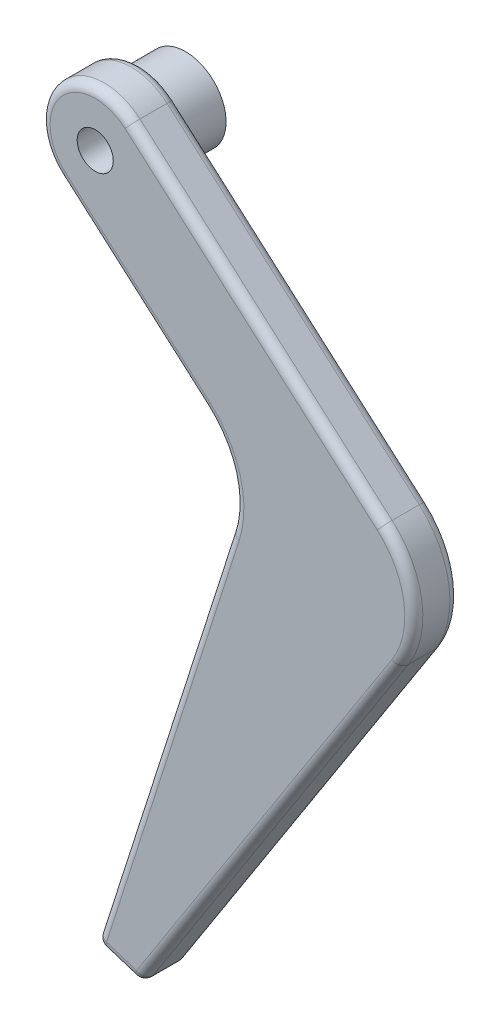
ISO-10303-21;
HEADER;
FILE_DESCRIPTION(('STEP AP214'),'2;1');
FILE_NAME('part.step','',(''),(''),'','','');
FILE_SCHEMA(('AUTOMOTIVE_DESIGN { 1 0 10303 214 1 1 1 1 }'));
ENDSEC;
DATA;
#1=APPLICATION_CONTEXT('core data for automotive mechanical design processes');
#2=APPLICATION_PROTOCOL_DEFINITION('international standard','automotive_design',2000,#1);
#3=PRODUCT_CONTEXT('',#1,'mechanical');
#4=PRODUCT('Part','Part','',(#3));
#5=PRODUCT_RELATED_PRODUCT_CATEGORY('part','',(#4));
#6=PRODUCT_DEFINITION_FORMATION('','',#4);
#7=PRODUCT_DEFINITION_CONTEXT('part definition',#1,'design');
#8=PRODUCT_DEFINITION('design','',#6,#7);
#9=PRODUCT_DEFINITION_SHAPE('','',#8);
#10=(LENGTH_UNIT() NAMED_UNIT(*) SI_UNIT(.MILLI.,.METRE.));
#11=(NAMED_UNIT(*) PLANE_ANGLE_UNIT() SI_UNIT($,.RADIAN.));
#12=(NAMED_UNIT(*) SI_UNIT($,.STERADIAN.) SOLID_ANGLE_UNIT());
#13=UNCERTAINTY_MEASURE_WITH_UNIT(LENGTH_MEASURE(1.E-05),#10,'distance_accuracy_value','');
#14=(GEOMETRIC_REPRESENTATION_CONTEXT(3) GLOBAL_UNCERTAINTY_ASSIGNED_CONTEXT((#13)) GLOBAL_UNIT_ASSIGNED_CONTEXT((#10,
#11,#12)) REPRESENTATION_CONTEXT('',''));
#15=CARTESIAN_POINT('',(0.,0.,0.));
#16=DIRECTION('',(0.,0.,1.));
#17=DIRECTION('',(1.,0.,0.));
#18=AXIS2_PLACEMENT_3D('',#15,#16,#17);
#19=CARTESIAN_POINT('',(-4.52162934195608,-76.1120795077343,2.5));
#20=DIRECTION('',(0.,0.,-1.));
#21=DIRECTION('',(-1.,0.,0.));
#22=AXIS2_PLACEMENT_3D('',#19,#20,#21);
#23=PLANE('',#22);
#24=DIRECTION('',(-0.30502949942289,-0.952342902783352,0.));
#25=VECTOR('',#24,1.);
#26=CARTESIAN_POINT('',(5.95414258866079,-79.4674040013861,2.5));
#27=LINE('',#26,#25);
#28=CARTESIAN_POINT('',(5.95414258866077,-79.4674040013862,2.5));
#29=VERTEX_POINT('',#28);
#30=CARTESIAN_POINT('',(-8.74262759779376,-125.352686596639,2.5));
#31=VERTEX_POINT('',#30);
#32=EDGE_CURVE('E239',#29,#31,#27,.T.);
#33=ORIENTED_EDGE('',*,*,#32,.T.);
#34=DIRECTION('',(0.952342902783352,-0.30502949942289,0.));
#35=VECTOR('',#34,1.);
#36=CARTESIAN_POINT('',(-19.2183995284107,-121.997362102988,2.5));
#37=LINE('',#36,#35);
#38=CARTESIAN_POINT('',(-5.425728911693,-126.415068584158,2.5));
#39=VERTEX_POINT('',#38);
#40=EDGE_CURVE('E248',#31,#39,#37,.T.);
#41=ORIENTED_EDGE('',*,*,#40,.T.);
#42=DIRECTION('',(0.541120351981146,0.840945161512807,0.));
#43=VECTOR('',#42,1.);
#44=CARTESIAN_POINT('',(17.7295046392763,-90.4299470726585,2.5));
#45=LINE('',#44,#43);
#46=CARTESIAN_POINT('',(22.8764762151391,-82.4311334495543,2.5));
#47=VERTEX_POINT('',#46);
#48=EDGE_CURVE('E246',#39,#47,#45,.T.);
#49=ORIENTED_EDGE('',*,*,#48,.T.);
#50=CARTESIAN_POINT('',(15.3079697615239,-77.5610502817239,2.5));
#51=DIRECTION('',(0.,0.,-1.));
#52=DIRECTION('',(-1.,0.,0.));
#53=AXIS2_PLACEMENT_3D('',#50,#51,#52);
#54=CIRCLE('',#53,9.00000000000001);
#55=CARTESIAN_POINT('',(21.2484075454404,-70.8000445181251,2.5));
#56=VERTEX_POINT('',#55);
#57=EDGE_CURVE('E187',#47,#56,#54,.F.);
#58=ORIENTED_EDGE('',*,*,#57,.T.);
#59=DIRECTION('',(-0.751222862622093,0.660048642657394,0.));
#60=VECTOR('',#59,1.);
#61=CARTESIAN_POINT('',(9.33939215384917,-60.3363993926704,2.5));
#62=LINE('',#61,#60);
#63=CARTESIAN_POINT('',(-6.69975678671304,-46.2438856868894,2.5));
#64=VERTEX_POINT('',#63);
#65=EDGE_CURVE('E243',#56,#64,#62,.T.);
#66=ORIENTED_EDGE('',*,*,#65,.T.);
#67=CARTESIAN_POINT('',(-10.,-49.9999999999999,2.5));
#68=DIRECTION('',(0.,0.,-1.));
#69=DIRECTION('',(-1.,0.,0.));
#70=AXIS2_PLACEMENT_3D('',#67,#68,#69);
#71=CIRCLE('',#70,5.);
#72=CARTESIAN_POINT('',(-13.300243213287,-53.7561143131104,2.5));
#73=VERTEX_POINT('',#72);
#74=EDGE_CURVE('E241',#64,#73,#71,.F.);
#75=ORIENTED_EDGE('',*,*,#74,.T.);
#76=DIRECTION('',(0.751222862622093,-0.660048642657394,0.));
#77=VECTOR('',#76,1.);
#78=CARTESIAN_POINT('',(2.73890572727524,-67.8486280188913,2.5));
#79=LINE('',#78,#77);
#80=CARTESIAN_POINT('',(2.7389057272752,-67.8486280188913,2.5));
#81=VERTEX_POINT('',#80);
#82=EDGE_CURVE('E235',#73,#81,#79,.T.);
#83=ORIENTED_EDGE('',*,*,#82,.T.);
#84=CARTESIAN_POINT('',(-4.52162934195608,-76.1120795077343,2.5));
#85=DIRECTION('',(0.,0.,-1.));
#86=DIRECTION('',(-1.,0.,0.));
#87=AXIS2_PLACEMENT_3D('',#84,#85,#86);
#88=CIRCLE('',#87,11.);
#89=EDGE_CURVE('E237',#81,#29,#88,.T.);
#90=ORIENTED_EDGE('',*,*,#89,.T.);
#91=EDGE_LOOP('',(#33,#41,#49,#58,#66,#75,#83,#90));
#92=FACE_BOUND('',#91,.T.);
#93=CARTESIAN_POINT('',(-10.,-49.9999999999999,2.5));
#94=DIRECTION('',(0.,0.,1.));
#95=DIRECTION('',(1.,0.,0.));
#96=AXIS2_PLACEMENT_3D('',#93,#94,#95);
#97=CIRCLE('',#96,2.);
#98=CARTESIAN_POINT('',(-8.00000000000001,-49.9999999999999,2.5));
#99=VERTEX_POINT('',#98);
#100=EDGE_CURVE('E325',#99,#99,#97,.T.);
#101=ORIENTED_EDGE('',*,*,#100,.F.);
#102=EDGE_LOOP('',(#101));
#103=FACE_BOUND('',#102,.T.);
#104=ADVANCED_FACE('F32',(#92,#103),#23,.F.);
#105=CARTESIAN_POINT('',(-4.52162934195608,-76.1120795077343,-2.5));
#106=DIRECTION('',(0.,0.,-1.));
#107=DIRECTION('',(-1.,0.,0.));
#108=AXIS2_PLACEMENT_3D('',#105,#106,#107);
#109=PLANE('',#108);
#110=CARTESIAN_POINT('',(-10.,-49.9999999999999,-2.5));
#111=DIRECTION('',(0.,0.,-1.));
#112=DIRECTION('',(-1.,0.,0.));
#113=AXIS2_PLACEMENT_3D('',#110,#111,#112);
#114=CIRCLE('',#113,4.5);
#115=CARTESIAN_POINT('',(-14.5,-49.9999999999999,-2.5));
#116=VERTEX_POINT('',#115);
#117=EDGE_CURVE('E782',#116,#116,#114,.T.);
#118=ORIENTED_EDGE('',*,*,#117,.F.);
#119=EDGE_LOOP('',(#118));
#120=FACE_BOUND('',#119,.T.);
#121=CARTESIAN_POINT('',(15.3079697615239,-77.5610502817239,-2.5));
#122=DIRECTION('',(0.,0.,-1.));
#123=DIRECTION('',(-1.,0.,0.));
#124=AXIS2_PLACEMENT_3D('',#121,#122,#123);
#125=CIRCLE('',#124,9.00000000000001);
#126=CARTESIAN_POINT('',(21.2484075454404,-70.8000445181251,-2.5));
#127=VERTEX_POINT('',#126);
#128=CARTESIAN_POINT('',(22.8764762151391,-82.4311334495543,-2.5));
#129=VERTEX_POINT('',#128);
#130=EDGE_CURVE('E214',#127,#129,#125,.T.);
#131=ORIENTED_EDGE('',*,*,#130,.T.);
#132=DIRECTION('',(0.541120351981146,0.840945161512807,0.));
#133=VECTOR('',#132,1.);
#134=CARTESIAN_POINT('',(-5.8409451615128,-127.060348501997,-2.5));
#135=LINE('',#134,#133);
#136=CARTESIAN_POINT('',(-5.425728911693,-126.415068584158,-2.5));
#137=VERTEX_POINT('',#136);
#138=EDGE_CURVE('E172',#129,#137,#135,.F.);
#139=ORIENTED_EDGE('',*,*,#138,.T.);
#140=DIRECTION('',(0.952342902783352,-0.30502949942289,0.));
#141=VECTOR('',#140,1.);
#142=CARTESIAN_POINT('',(-9.69497050057711,-125.047657097217,-2.5));
#143=LINE('',#142,#141);
#144=CARTESIAN_POINT('',(-8.74262759779375,-125.352686596639,-2.5));
#145=VERTEX_POINT('',#144);
#146=EDGE_CURVE('E204',#137,#145,#143,.F.);
#147=ORIENTED_EDGE('',*,*,#146,.T.);
#148=DIRECTION('',(-0.30502949942289,-0.952342902783352,0.));
#149=VECTOR('',#148,1.);
#150=CARTESIAN_POINT('',(5.95414258866077,-79.4674040013862,-2.5));
#151=LINE('',#150,#149);
#152=CARTESIAN_POINT('',(5.95414258866077,-79.4674040013862,-2.5));
#153=VERTEX_POINT('',#152);
#154=EDGE_CURVE('E199',#145,#153,#151,.F.);
#155=ORIENTED_EDGE('',*,*,#154,.T.);
#156=CARTESIAN_POINT('',(-4.52162934195608,-76.1120795077343,-2.5));
#157=DIRECTION('',(0.,0.,-1.));
#158=DIRECTION('',(-1.,0.,0.));
#159=AXIS2_PLACEMENT_3D('',#156,#157,#158);
#160=CIRCLE('',#159,11.);
#161=CARTESIAN_POINT('',(2.73890572727521,-67.8486280188913,-2.5));
#162=VERTEX_POINT('',#161);
#163=EDGE_CURVE('E206',#153,#162,#160,.F.);
#164=ORIENTED_EDGE('',*,*,#163,.T.);
#165=DIRECTION('',(0.751222862622093,-0.660048642657394,0.));
#166=VECTOR('',#165,1.);
#167=CARTESIAN_POINT('',(-13.300243213287,-53.7561143131104,-2.5));
#168=LINE('',#167,#166);
#169=CARTESIAN_POINT('',(-13.300243213287,-53.7561143131104,-2.5));
#170=VERTEX_POINT('',#169);
#171=EDGE_CURVE('E208',#162,#170,#168,.F.);
#172=ORIENTED_EDGE('',*,*,#171,.T.);
#173=CARTESIAN_POINT('',(-10.,-49.9999999999999,-2.5));
#174=DIRECTION('',(0.,0.,-1.));
#175=DIRECTION('',(-1.,0.,0.));
#176=AXIS2_PLACEMENT_3D('',#173,#174,#175);
#177=CIRCLE('',#176,5.);
#178=CARTESIAN_POINT('',(-6.69975678671304,-46.2438856868894,-2.5));
#179=VERTEX_POINT('',#178);
#180=EDGE_CURVE('E210',#170,#179,#177,.T.);
#181=ORIENTED_EDGE('',*,*,#180,.T.);
#182=DIRECTION('',(-0.751222862622093,0.660048642657394,0.));
#183=VECTOR('',#182,1.);
#184=CARTESIAN_POINT('',(21.2484075454404,-70.8000445181251,-2.5));
#185=LINE('',#184,#183);
#186=EDGE_CURVE('E212',#179,#127,#185,.F.);
#187=ORIENTED_EDGE('',*,*,#186,.T.);
#188=EDGE_LOOP('',(#131,#139,#147,#155,#164,#172,#181,#187));
#189=FACE_BOUND('',#188,.T.);
#190=ADVANCED_FACE('F362',(#120,#189),#109,.T.);
#191=CARTESIAN_POINT('',(-9.99999999999999,-126.,2.5));
#192=DIRECTION('',(0.952342902783352,-0.30502949942289,0.));
#193=DIRECTION('',(0.30502949942289,0.952342902783352,0.));
#194=AXIS2_PLACEMENT_3D('',#191,#192,#193);
#195=PLANE('',#194);
#196=DIRECTION('',(0.,0.,-1.));
#197=VECTOR('',#196,1.);
#198=CARTESIAN_POINT('',(-9.69497050057711,-125.047657097217,2.5));
#199=LINE('',#198,#197);
#200=CARTESIAN_POINT('',(-9.69497050057711,-125.047657097217,-1.5));
#201=VERTEX_POINT('',#200);
#202=CARTESIAN_POINT('',(-9.69497050057711,-125.047657097217,1.5));
#203=VERTEX_POINT('',#202);
#204=EDGE_CURVE('E252',#201,#203,#199,.F.);
#205=ORIENTED_EDGE('',*,*,#204,.T.);
#206=DIRECTION('',(-0.30502949942289,-0.952342902783352,0.));
#207=VECTOR('',#206,1.);
#208=CARTESIAN_POINT('',(-9.99999999999999,-126.,1.5));
#209=LINE('',#208,#207);
#210=CARTESIAN_POINT('',(5.00179968587742,-79.1623745019633,1.5));
#211=VERTEX_POINT('',#210);
#212=EDGE_CURVE('E254',#203,#211,#209,.F.);
#213=ORIENTED_EDGE('',*,*,#212,.T.);
#214=DIRECTION('',(0.,0.,-1.));
#215=VECTOR('',#214,1.);
#216=CARTESIAN_POINT('',(5.00179968587742,-79.1623745019633,2.5));
#217=LINE('',#216,#215);
#218=CARTESIAN_POINT('',(5.00179968587742,-79.1623745019633,-1.5));
#219=VERTEX_POINT('',#218);
#220=EDGE_CURVE('E330',#211,#219,#217,.T.);
#221=ORIENTED_EDGE('',*,*,#220,.T.);
#222=DIRECTION('',(-0.30502949942289,-0.952342902783352,0.));
#223=VECTOR('',#222,1.);
#224=CARTESIAN_POINT('',(-9.99999999999999,-126.,-1.5));
#225=LINE('',#224,#223);
#226=EDGE_CURVE('E250',#219,#201,#225,.T.);
#227=ORIENTED_EDGE('',*,*,#226,.T.);
#228=EDGE_LOOP('',(#205,#213,#221,#227));
#229=FACE_BOUND('',#228,.T.);
#230=ADVANCED_FACE('F388',(#229),#195,.F.);
#231=CARTESIAN_POINT('',(-9.99999999999999,-126.,2.5));
#232=DIRECTION('',(0.30502949942289,0.952342902783352,0.));
#233=DIRECTION('',(-0.952342902783352,0.30502949942289,0.));
#234=AXIS2_PLACEMENT_3D('',#231,#232,#233);
#235=PLANE('',#234);
#236=DIRECTION('',(0.,0.,-1.));
#237=VECTOR('',#236,1.);
#238=CARTESIAN_POINT('',(-9.04765709721666,-126.305029499423,2.5));
#239=LINE('',#238,#237);
#240=CARTESIAN_POINT('',(-9.04765709721666,-126.305029499423,1.5));
#241=VERTEX_POINT('',#240);
#242=CARTESIAN_POINT('',(-9.04765709721666,-126.305029499423,-1.5));
#243=VERTEX_POINT('',#242);
#244=EDGE_CURVE('E256',#241,#243,#239,.T.);
#245=ORIENTED_EDGE('',*,*,#244,.T.);
#246=DIRECTION('',(0.952342902783352,-0.30502949942289,0.));
#247=VECTOR('',#246,1.);
#248=CARTESIAN_POINT('',(-4.99999999999999,-127.601468853978,-1.5));
#249=LINE('',#248,#247);
#250=CARTESIAN_POINT('',(-5.73075841111589,-127.367411486941,-1.5));
#251=VERTEX_POINT('',#250);
#252=EDGE_CURVE('E11',#243,#251,#249,.T.);
#253=ORIENTED_EDGE('',*,*,#252,.T.);
#254=DIRECTION('',(0.,0.,-1.));
#255=VECTOR('',#254,1.);
#256=CARTESIAN_POINT('',(-5.7307584111159,-127.367411486941,2.5));
#257=LINE('',#256,#255);
#258=CARTESIAN_POINT('',(-5.7307584111159,-127.367411486941,1.5));
#259=VERTEX_POINT('',#258);
#260=EDGE_CURVE('E41',#251,#259,#257,.F.);
#261=ORIENTED_EDGE('',*,*,#260,.T.);
#262=DIRECTION('',(0.952342902783352,-0.30502949942289,0.));
#263=VECTOR('',#262,1.);
#264=CARTESIAN_POINT('',(-9.99999999999999,-126.,1.5));
#265=LINE('',#264,#263);
#266=EDGE_CURVE('E258',#259,#241,#265,.F.);
#267=ORIENTED_EDGE('',*,*,#266,.T.);
#268=EDGE_LOOP('',(#245,#253,#261,#267));
#269=FACE_BOUND('',#268,.T.);
#270=ADVANCED_FACE('F466',(#269),#235,.F.);
#271=CARTESIAN_POINT('',(-5.,-127.601468853978,2.5));
#272=DIRECTION('',(-0.840945161512807,0.541120351981146,0.));
#273=DIRECTION('',(-0.541120351981146,-0.840945161512807,0.));
#274=AXIS2_PLACEMENT_3D('',#271,#272,#273);
#275=PLANE('',#274);
#276=DIRECTION('',(0.,0.,-1.));
#277=VECTOR('',#276,1.);
#278=CARTESIAN_POINT('',(-4.58478375018019,-126.956188936139,2.5));
#279=LINE('',#278,#277);
#280=CARTESIAN_POINT('',(-4.58478375018019,-126.956188936139,1.5));
#281=VERTEX_POINT('',#280);
#282=CARTESIAN_POINT('',(-4.58478375018019,-126.956188936139,-1.5));
#283=VERTEX_POINT('',#282);
#284=EDGE_CURVE('E182',#281,#283,#279,.T.);
#285=ORIENTED_EDGE('',*,*,#284,.T.);
#286=DIRECTION('',(0.541120351981146,0.840945161512807,0.));
#287=VECTOR('',#286,1.);
#288=CARTESIAN_POINT('',(23.7174213766519,-82.9722538015355,-1.5));
#289=LINE('',#288,#287);
#290=CARTESIAN_POINT('',(23.7174213766519,-82.9722538015355,-1.5));
#291=VERTEX_POINT('',#290);
#292=EDGE_CURVE('E181',#283,#291,#289,.T.);
#293=ORIENTED_EDGE('',*,*,#292,.T.);
#294=DIRECTION('',(0.,0.,-1.));
#295=VECTOR('',#294,1.);
#296=CARTESIAN_POINT('',(23.7174213766519,-82.9722538015355,2.5));
#297=LINE('',#296,#295);
#298=CARTESIAN_POINT('',(23.7174213766519,-82.9722538015355,1.5));
#299=VERTEX_POINT('',#298);
#300=EDGE_CURVE('E164',#299,#291,#297,.T.);
#301=ORIENTED_EDGE('',*,*,#300,.F.);
#302=DIRECTION('',(0.541120351981146,0.840945161512807,0.));
#303=VECTOR('',#302,1.);
#304=CARTESIAN_POINT('',(-5.,-127.601468853978,1.5));
#305=LINE('',#304,#303);
#306=EDGE_CURVE('E178',#299,#281,#305,.F.);
#307=ORIENTED_EDGE('',*,*,#306,.T.);
#308=EDGE_LOOP('',(#285,#293,#301,#307));
#309=FACE_BOUND('',#308,.T.);
#310=ADVANCED_FACE('F176',(#309),#275,.F.);
#311=CARTESIAN_POINT('',(15.3079697615239,-77.5610502817239,2.5));
#312=DIRECTION('',(0.,0.,-1.));
#313=DIRECTION('',(-1.,0.,0.));
#314=AXIS2_PLACEMENT_3D('',#311,#312,#313);
#315=CYLINDRICAL_SURFACE('',#314,10.);
#316=ORIENTED_EDGE('',*,*,#300,.T.);
#317=CARTESIAN_POINT('',(15.3079697615239,-77.5610502817239,-1.5));
#318=DIRECTION('',(0.,0.,-1.));
#319=DIRECTION('',(-1.,0.,0.));
#320=AXIS2_PLACEMENT_3D('',#317,#318,#319);
#321=CIRCLE('',#320,10.);
#322=CARTESIAN_POINT('',(21.9084561880978,-70.048821655503,-1.5));
#323=VERTEX_POINT('',#322);
#324=EDGE_CURVE('E171',#291,#323,#321,.F.);
#325=ORIENTED_EDGE('',*,*,#324,.T.);
#326=DIRECTION('',(0.,0.,-1.));
#327=VECTOR('',#326,1.);
#328=CARTESIAN_POINT('',(21.9084561880978,-70.048821655503,2.5));
#329=LINE('',#328,#327);
#330=CARTESIAN_POINT('',(21.9084561880978,-70.048821655503,1.5));
#331=VERTEX_POINT('',#330);
#332=EDGE_CURVE('E166',#331,#323,#329,.T.);
#333=ORIENTED_EDGE('',*,*,#332,.F.);
#334=CARTESIAN_POINT('',(15.3079697615239,-77.5610502817239,1.5));
#335=DIRECTION('',(0.,0.,-1.));
#336=DIRECTION('',(-1.,0.,0.));
#337=AXIS2_PLACEMENT_3D('',#334,#335,#336);
#338=CIRCLE('',#337,10.);
#339=EDGE_CURVE('E161',#331,#299,#338,.T.);
#340=ORIENTED_EDGE('',*,*,#339,.T.);
#341=EDGE_LOOP('',(#316,#325,#333,#340));
#342=FACE_BOUND('',#341,.T.);
#343=ADVANCED_FACE('F163',(#342),#315,.T.);
#344=CARTESIAN_POINT('',(-6.03970814405565,-45.4926628242673,2.5));
#345=DIRECTION('',(-0.660048642657393,-0.751222862622093,0.));
#346=DIRECTION('',(0.751222862622093,-0.660048642657394,0.));
#347=AXIS2_PLACEMENT_3D('',#344,#345,#346);
#348=PLANE('',#347);
#349=ORIENTED_EDGE('',*,*,#332,.T.);
#350=DIRECTION('',(-0.751222862622093,0.660048642657394,0.));
#351=VECTOR('',#350,1.);
#352=CARTESIAN_POINT('',(-6.03970814405565,-45.4926628242673,-1.5));
#353=LINE('',#352,#351);
#354=CARTESIAN_POINT('',(-6.03970814405565,-45.4926628242673,-1.5));
#355=VERTEX_POINT('',#354);
#356=EDGE_CURVE('E221',#323,#355,#353,.T.);
#357=ORIENTED_EDGE('',*,*,#356,.T.);
#358=DIRECTION('',(0.,0.,-1.));
#359=VECTOR('',#358,1.);
#360=CARTESIAN_POINT('',(-6.03970814405565,-45.4926628242673,2.5));
#361=LINE('',#360,#359);
#362=CARTESIAN_POINT('',(-6.03970814405565,-45.4926628242673,1.5));
#363=VERTEX_POINT('',#362);
#364=EDGE_CURVE('E342',#363,#355,#361,.T.);
#365=ORIENTED_EDGE('',*,*,#364,.F.);
#366=DIRECTION('',(-0.751222862622093,0.660048642657394,0.));
#367=VECTOR('',#366,1.);
#368=CARTESIAN_POINT('',(-6.03970814405565,-45.4926628242673,1.5));
#369=LINE('',#368,#367);
#370=EDGE_CURVE('E219',#363,#331,#369,.F.);
#371=ORIENTED_EDGE('',*,*,#370,.T.);
#372=EDGE_LOOP('',(#349,#357,#365,#371));
#373=FACE_BOUND('',#372,.T.);
#374=ADVANCED_FACE('F347',(#373),#348,.F.);
#375=CARTESIAN_POINT('',(-10.,-49.9999999999999,2.5));
#376=DIRECTION('',(0.,0.,-1.));
#377=DIRECTION('',(-1.,0.,0.));
#378=AXIS2_PLACEMENT_3D('',#375,#376,#377);
#379=CYLINDRICAL_SURFACE('',#378,6.);
#380=ORIENTED_EDGE('',*,*,#364,.T.);
#381=CARTESIAN_POINT('',(-10.,-49.9999999999999,-1.5));
#382=DIRECTION('',(0.,0.,-1.));
#383=DIRECTION('',(-1.,0.,0.));
#384=AXIS2_PLACEMENT_3D('',#381,#382,#383);
#385=CIRCLE('',#384,6.);
#386=CARTESIAN_POINT('',(-13.9602918559444,-54.5073371757325,-1.5));
#387=VERTEX_POINT('',#386);
#388=EDGE_CURVE('E225',#355,#387,#385,.F.);
#389=ORIENTED_EDGE('',*,*,#388,.T.);
#390=DIRECTION('',(0.,0.,-1.));
#391=VECTOR('',#390,1.);
#392=CARTESIAN_POINT('',(-13.9602918559444,-54.5073371757325,2.5));
#393=LINE('',#392,#391);
#394=CARTESIAN_POINT('',(-13.9602918559444,-54.5073371757325,1.5));
#395=VERTEX_POINT('',#394);
#396=EDGE_CURVE('E339',#395,#387,#393,.T.);
#397=ORIENTED_EDGE('',*,*,#396,.F.);
#398=CARTESIAN_POINT('',(-10.,-49.9999999999999,1.5));
#399=DIRECTION('',(0.,0.,-1.));
#400=DIRECTION('',(-1.,0.,0.));
#401=AXIS2_PLACEMENT_3D('',#398,#399,#400);
#402=CIRCLE('',#401,6.);
#403=EDGE_CURVE('E223',#395,#363,#402,.T.);
#404=ORIENTED_EDGE('',*,*,#403,.T.);
#405=EDGE_LOOP('',(#380,#389,#397,#404));
#406=FACE_BOUND('',#405,.T.);
#407=ADVANCED_FACE('F423',(#406),#379,.T.);
#408=CARTESIAN_POINT('',(2.07885708461781,-68.5998508815134,2.5));
#409=DIRECTION('',(0.660048642657393,0.751222862622093,0.));
#410=DIRECTION('',(-0.751222862622093,0.660048642657394,0.));
#411=AXIS2_PLACEMENT_3D('',#408,#409,#410);
#412=PLANE('',#411);
#413=ORIENTED_EDGE('',*,*,#396,.T.);
#414=DIRECTION('',(0.751222862622093,-0.660048642657394,0.));
#415=VECTOR('',#414,1.);
#416=CARTESIAN_POINT('',(2.07885708461781,-68.5998508815134,-1.5));
#417=LINE('',#416,#415);
#418=CARTESIAN_POINT('',(2.07885708461781,-68.5998508815134,-1.5));
#419=VERTEX_POINT('',#418);
#420=EDGE_CURVE('E229',#387,#419,#417,.T.);
#421=ORIENTED_EDGE('',*,*,#420,.T.);
#422=DIRECTION('',(0.,0.,-1.));
#423=VECTOR('',#422,1.);
#424=CARTESIAN_POINT('',(2.07885708461781,-68.5998508815134,2.5));
#425=LINE('',#424,#423);
#426=CARTESIAN_POINT('',(2.07885708461781,-68.5998508815134,1.5));
#427=VERTEX_POINT('',#426);
#428=EDGE_CURVE('E336',#427,#419,#425,.T.);
#429=ORIENTED_EDGE('',*,*,#428,.F.);
#430=DIRECTION('',(0.751222862622093,-0.660048642657394,0.));
#431=VECTOR('',#430,1.);
#432=CARTESIAN_POINT('',(2.07885708461781,-68.5998508815134,1.5));
#433=LINE('',#432,#431);
#434=EDGE_CURVE('E227',#427,#395,#433,.F.);
#435=ORIENTED_EDGE('',*,*,#434,.T.);
#436=EDGE_LOOP('',(#413,#421,#429,#435));
#437=FACE_BOUND('',#436,.T.);
#438=ADVANCED_FACE('F412',(#437),#412,.F.);
#439=CARTESIAN_POINT('',(-4.52162934195608,-76.1120795077343,2.5));
#440=DIRECTION('',(0.,0.,-1.));
#441=DIRECTION('',(-1.,0.,0.));
#442=AXIS2_PLACEMENT_3D('',#439,#440,#441);
#443=CYLINDRICAL_SURFACE('',#442,9.99999999999999);
#444=ORIENTED_EDGE('',*,*,#428,.T.);
#445=CARTESIAN_POINT('',(-4.52162934195608,-76.1120795077343,-1.5));
#446=DIRECTION('',(0.,0.,-1.));
#447=DIRECTION('',(-1.,0.,0.));
#448=AXIS2_PLACEMENT_3D('',#445,#446,#447);
#449=CIRCLE('',#448,9.99999999999999);
#450=EDGE_CURVE('E233',#419,#219,#449,.T.);
#451=ORIENTED_EDGE('',*,*,#450,.T.);
#452=ORIENTED_EDGE('',*,*,#220,.F.);
#453=CARTESIAN_POINT('',(-4.52162934195608,-76.1120795077343,1.5));
#454=DIRECTION('',(0.,0.,-1.));
#455=DIRECTION('',(-1.,0.,0.));
#456=AXIS2_PLACEMENT_3D('',#453,#454,#455);
#457=CIRCLE('',#456,9.99999999999999);
#458=EDGE_CURVE('E231',#211,#427,#457,.F.);
#459=ORIENTED_EDGE('',*,*,#458,.T.);
#460=EDGE_LOOP('',(#444,#451,#452,#459));
#461=FACE_BOUND('',#460,.T.);
#462=ADVANCED_FACE('F408',(#461),#443,.F.);
#463=CARTESIAN_POINT('',(-10.,-49.9999999999999,2.5));
#464=DIRECTION('',(0.,0.,-1.));
#465=DIRECTION('',(-1.,0.,0.));
#466=AXIS2_PLACEMENT_3D('',#463,#464,#465);
#467=CYLINDRICAL_SURFACE('',#466,2.);
#468=ORIENTED_EDGE('',*,*,#100,.T.);
#469=EDGE_LOOP('',(#468));
#470=FACE_BOUND('',#469,.T.);
#471=CARTESIAN_POINT('',(-10.,-49.9999999999999,-2.5));
#472=DIRECTION('',(0.,0.,1.));
#473=DIRECTION('',(1.,0.,0.));
#474=AXIS2_PLACEMENT_3D('',#471,#472,#473);
#475=CIRCLE('',#474,2.);
#476=CARTESIAN_POINT('',(-8.00000000000001,-49.9999999999999,-2.5));
#477=VERTEX_POINT('',#476);
#478=EDGE_CURVE('E319',#477,#477,#475,.T.);
#479=ORIENTED_EDGE('',*,*,#478,.F.);
#480=EDGE_LOOP('',(#479));
#481=FACE_BOUND('',#480,.T.);
#482=ADVANCED_FACE('F451',(#470,#481),#467,.F.);
#483=CARTESIAN_POINT('',(2.73890572727524,-67.8486280188913,1.5));
#484=DIRECTION('',(0.751222862622093,-0.660048642657394,0.));
#485=DIRECTION('',(0.660048642657393,0.751222862622093,0.));
#486=AXIS2_PLACEMENT_3D('',#483,#484,#485);
#487=CYLINDRICAL_SURFACE('',#486,1.);
#488=CARTESIAN_POINT('',(-13.300243213287,-53.7561143131104,1.5));
#489=DIRECTION('',(-0.751222862622094,0.660048642657393,0.));
#490=DIRECTION('',(-0.660048642657393,-0.751222862622094,0.));
#491=AXIS2_PLACEMENT_3D('',#488,#489,#490);
#492=CIRCLE('',#491,1.);
#493=EDGE_CURVE('E315',#395,#73,#492,.T.);
#494=ORIENTED_EDGE('',*,*,#493,.F.);
#495=ORIENTED_EDGE('',*,*,#434,.F.);
#496=CARTESIAN_POINT('',(2.7389057272752,-67.8486280188913,1.5));
#497=DIRECTION('',(0.751222862622095,-0.660048642657392,0.));
#498=DIRECTION('',(0.660048642657392,0.751222862622095,0.));
#499=AXIS2_PLACEMENT_3D('',#496,#497,#498);
#500=CIRCLE('',#499,1.);
#501=EDGE_CURVE('E317',#81,#427,#500,.T.);
#502=ORIENTED_EDGE('',*,*,#501,.F.);
#503=ORIENTED_EDGE('',*,*,#82,.F.);
#504=EDGE_LOOP('',(#494,#495,#502,#503));
#505=FACE_BOUND('',#504,.T.);
#506=ADVANCED_FACE('F34',(#505),#487,.T.);
#507=CARTESIAN_POINT('',(-4.52162934195608,-76.1120795077343,1.5));
#508=DIRECTION('',(0.,0.,-1.));
#509=DIRECTION('',(-1.,0.,0.));
#510=AXIS2_PLACEMENT_3D('',#507,#508,#509);
#511=TOROIDAL_SURFACE('',#510,11.,1.);
#512=ORIENTED_EDGE('',*,*,#501,.T.);
#513=ORIENTED_EDGE('',*,*,#458,.F.);
#514=CARTESIAN_POINT('',(5.95414258866077,-79.4674040013862,1.5));
#515=DIRECTION('',(-0.30502949942289,-0.952342902783352,0.));
#516=DIRECTION('',(0.952342902783352,-0.30502949942289,0.));
#517=AXIS2_PLACEMENT_3D('',#514,#515,#516);
#518=CIRCLE('',#517,1.);
#519=EDGE_CURVE('E312',#29,#211,#518,.T.);
#520=ORIENTED_EDGE('',*,*,#519,.F.);
#521=ORIENTED_EDGE('',*,*,#89,.F.);
#522=EDGE_LOOP('',(#512,#513,#520,#521));
#523=FACE_BOUND('',#522,.T.);
#524=ADVANCED_FACE('F405',(#523),#511,.T.);
#525=CARTESIAN_POINT('',(-10.,-49.9999999999999,1.5));
#526=DIRECTION('',(0.,0.,-1.));
#527=DIRECTION('',(-1.,0.,0.));
#528=AXIS2_PLACEMENT_3D('',#525,#526,#527);
#529=TOROIDAL_SURFACE('',#528,5.,1.);
#530=ORIENTED_EDGE('',*,*,#493,.T.);
#531=ORIENTED_EDGE('',*,*,#74,.F.);
#532=CARTESIAN_POINT('',(-6.69975678671304,-46.2438856868894,1.5));
#533=DIRECTION('',(0.751222862622094,-0.660048642657393,0.));
#534=DIRECTION('',(0.660048642657393,0.751222862622094,0.));
#535=AXIS2_PLACEMENT_3D('',#532,#533,#534);
#536=CIRCLE('',#535,1.);
#537=EDGE_CURVE('E309',#363,#64,#536,.T.);
#538=ORIENTED_EDGE('',*,*,#537,.F.);
#539=ORIENTED_EDGE('',*,*,#403,.F.);
#540=EDGE_LOOP('',(#530,#531,#538,#539));
#541=FACE_BOUND('',#540,.T.);
#542=ADVANCED_FACE('F421',(#541),#529,.T.);
#543=CARTESIAN_POINT('',(5.95414258866078,-79.4674040013861,1.5));
#544=DIRECTION('',(-0.30502949942289,-0.952342902783352,0.));
#545=DIRECTION('',(0.952342902783352,-0.30502949942289,0.));
#546=AXIS2_PLACEMENT_3D('',#543,#544,#545);
#547=CYLINDRICAL_SURFACE('',#546,1.);
#548=ORIENTED_EDGE('',*,*,#519,.T.);
#549=ORIENTED_EDGE('',*,*,#212,.F.);
#550=CARTESIAN_POINT('',(-8.74262759779376,-125.352686596639,1.5));
#551=DIRECTION('',(-0.305029499422878,-0.952342902783356,0.));
#552=DIRECTION('',(0.952342902783356,-0.305029499422878,0.));
#553=AXIS2_PLACEMENT_3D('',#550,#551,#552);
#554=CIRCLE('',#553,1.);
#555=EDGE_CURVE('E306',#31,#203,#554,.T.);
#556=ORIENTED_EDGE('',*,*,#555,.F.);
#557=ORIENTED_EDGE('',*,*,#32,.F.);
#558=EDGE_LOOP('',(#548,#549,#556,#557));
#559=FACE_BOUND('',#558,.T.);
#560=ADVANCED_FACE('F392',(#559),#547,.T.);
#561=CARTESIAN_POINT('',(9.33939215384917,-60.3363993926704,1.5));
#562=DIRECTION('',(-0.751222862622093,0.660048642657394,0.));
#563=DIRECTION('',(-0.660048642657393,-0.751222862622093,0.));
#564=AXIS2_PLACEMENT_3D('',#561,#562,#563);
#565=CYLINDRICAL_SURFACE('',#564,1.);
#566=ORIENTED_EDGE('',*,*,#537,.T.);
#567=ORIENTED_EDGE('',*,*,#65,.F.);
#568=CARTESIAN_POINT('',(21.2484075454404,-70.8000445181251,1.5));
#569=DIRECTION('',(0.751222862622094,-0.660048642657392,0.));
#570=DIRECTION('',(0.660048642657392,0.751222862622094,0.));
#571=AXIS2_PLACEMENT_3D('',#568,#569,#570);
#572=CIRCLE('',#571,1.);
#573=EDGE_CURVE('E304',#331,#56,#572,.T.);
#574=ORIENTED_EDGE('',*,*,#573,.F.);
#575=ORIENTED_EDGE('',*,*,#370,.F.);
#576=EDGE_LOOP('',(#566,#567,#574,#575));
#577=FACE_BOUND('',#576,.T.);
#578=ADVANCED_FACE('F659',(#577),#565,.T.);
#579=CARTESIAN_POINT('',(-8.74262759779376,-125.352686596639,1.5));
#580=DIRECTION('',(-0.952342902783356,0.305029499422879,0.));
#581=DIRECTION('',(-0.305029499422879,-0.952342902783356,0.));
#582=AXIS2_PLACEMENT_3D('',#579,#580,#581);
#583=SPHERICAL_SURFACE('',#582,1.);
#584=CARTESIAN_POINT('',(-8.74262759779377,-125.352686596639,1.5));
#585=DIRECTION('',(-0.952342902783351,0.305029499422893,0.));
#586=DIRECTION('',(-0.305029499422893,-0.952342902783351,0.));
#587=AXIS2_PLACEMENT_3D('',#584,#585,#586);
#588=CIRCLE('',#587,1.);
#589=EDGE_CURVE('E191',#31,#241,#588,.F.);
#590=ORIENTED_EDGE('',*,*,#589,.F.);
#591=ORIENTED_EDGE('',*,*,#555,.T.);
#592=CARTESIAN_POINT('',(-8.74262759779376,-125.352686596639,1.5));
#593=DIRECTION('',(0.,0.,1.));
#594=DIRECTION('',(1.,0.,0.));
#595=AXIS2_PLACEMENT_3D('',#592,#593,#594);
#596=CIRCLE('',#595,1.);
#597=EDGE_CURVE('E298',#241,#203,#596,.F.);
#598=ORIENTED_EDGE('',*,*,#597,.F.);
#599=EDGE_LOOP('',(#590,#591,#598));
#600=FACE_BOUND('',#599,.T.);
#601=ADVANCED_FACE('F397',(#600),#583,.T.);
#602=CARTESIAN_POINT('',(15.3079697615239,-77.5610502817239,1.5));
#603=DIRECTION('',(0.,0.,-1.));
#604=DIRECTION('',(-1.,0.,0.));
#605=AXIS2_PLACEMENT_3D('',#602,#603,#604);
#606=TOROIDAL_SURFACE('',#605,9.00000000000001,1.);
#607=ORIENTED_EDGE('',*,*,#573,.T.);
#608=ORIENTED_EDGE('',*,*,#57,.F.);
#609=CARTESIAN_POINT('',(22.8764762151391,-82.4311334495543,1.5));
#610=DIRECTION('',(-0.541120351981147,-0.840945161512806,0.));
#611=DIRECTION('',(0.840945161512806,-0.541120351981147,0.));
#612=AXIS2_PLACEMENT_3D('',#609,#610,#611);
#613=CIRCLE('',#612,1.);
#614=EDGE_CURVE('E185',#299,#47,#613,.T.);
#615=ORIENTED_EDGE('',*,*,#614,.F.);
#616=ORIENTED_EDGE('',*,*,#339,.F.);
#617=EDGE_LOOP('',(#607,#608,#615,#616));
#618=FACE_BOUND('',#617,.T.);
#619=ADVANCED_FACE('F186',(#618),#606,.T.);
#620=CARTESIAN_POINT('',(-4.52162934195608,-76.1120795077343,-1.5));
#621=DIRECTION('',(0.,0.,-1.));
#622=DIRECTION('',(-1.,0.,0.));
#623=AXIS2_PLACEMENT_3D('',#620,#621,#622);
#624=TOROIDAL_SURFACE('',#623,11.,1.);
#625=CARTESIAN_POINT('',(2.73890572727521,-67.8486280188913,-1.5));
#626=DIRECTION('',(-0.751222862622094,0.660048642657393,0.));
#627=DIRECTION('',(-0.660048642657393,-0.751222862622094,0.));
#628=AXIS2_PLACEMENT_3D('',#625,#626,#627);
#629=CIRCLE('',#628,1.);
#630=EDGE_CURVE('E192',#162,#419,#629,.T.);
#631=ORIENTED_EDGE('',*,*,#630,.F.);
#632=ORIENTED_EDGE('',*,*,#163,.F.);
#633=CARTESIAN_POINT('',(5.95414258866077,-79.4674040013862,-1.5));
#634=DIRECTION('',(-0.305029499422891,-0.952342902783352,0.));
#635=DIRECTION('',(0.952342902783352,-0.305029499422891,0.));
#636=AXIS2_PLACEMENT_3D('',#633,#634,#635);
#637=CIRCLE('',#636,1.);
#638=EDGE_CURVE('E301',#219,#153,#637,.T.);
#639=ORIENTED_EDGE('',*,*,#638,.F.);
#640=ORIENTED_EDGE('',*,*,#450,.F.);
#641=EDGE_LOOP('',(#631,#632,#639,#640));
#642=FACE_BOUND('',#641,.T.);
#643=ADVANCED_FACE('F434',(#642),#624,.T.);
#644=CARTESIAN_POINT('',(-9.04765709721664,-126.305029499423,-1.5));
#645=DIRECTION('',(0.30502949942289,0.952342902783352,0.));
#646=DIRECTION('',(-0.952342902783352,0.30502949942289,0.));
#647=AXIS2_PLACEMENT_3D('',#644,#645,#646);
#648=CYLINDRICAL_SURFACE('',#647,1.);
#649=ORIENTED_EDGE('',*,*,#638,.T.);
#650=ORIENTED_EDGE('',*,*,#154,.F.);
#651=CARTESIAN_POINT('',(-8.74262759779376,-125.352686596639,-1.5));
#652=DIRECTION('',(-0.305029499422878,-0.952342902783356,0.));
#653=DIRECTION('',(0.952342902783356,-0.305029499422878,0.));
#654=AXIS2_PLACEMENT_3D('',#651,#652,#653);
#655=CIRCLE('',#654,1.);
#656=EDGE_CURVE('E291',#201,#145,#655,.T.);
#657=ORIENTED_EDGE('',*,*,#656,.F.);
#658=ORIENTED_EDGE('',*,*,#226,.F.);
#659=EDGE_LOOP('',(#649,#650,#657,#658));
#660=FACE_BOUND('',#659,.T.);
#661=ADVANCED_FACE('F375',(#660),#648,.T.);
#662=CARTESIAN_POINT('',(-8.74262759779376,-125.352686596639,2.5));
#663=DIRECTION('',(0.,0.,-1.));
#664=DIRECTION('',(-1.,0.,0.));
#665=AXIS2_PLACEMENT_3D('',#662,#663,#664);
#666=CYLINDRICAL_SURFACE('',#665,1.);
#667=ORIENTED_EDGE('',*,*,#597,.T.);
#668=ORIENTED_EDGE('',*,*,#204,.F.);
#669=CARTESIAN_POINT('',(-8.74262759779377,-125.352686596639,-1.5));
#670=DIRECTION('',(0.,0.,-1.));
#671=DIRECTION('',(-1.,0.,0.));
#672=AXIS2_PLACEMENT_3D('',#669,#670,#671);
#673=CIRCLE('',#672,1.);
#674=EDGE_CURVE('E288',#243,#201,#673,.T.);
#675=ORIENTED_EDGE('',*,*,#674,.F.);
#676=ORIENTED_EDGE('',*,*,#244,.F.);
#677=EDGE_LOOP('',(#667,#668,#675,#676));
#678=FACE_BOUND('',#677,.T.);
#679=ADVANCED_FACE('F384',(#678),#666,.T.);
#680=CARTESIAN_POINT('',(-19.2183995284107,-121.997362102988,1.5));
#681=DIRECTION('',(0.952342902783352,-0.30502949942289,0.));
#682=DIRECTION('',(0.30502949942289,0.952342902783352,0.));
#683=AXIS2_PLACEMENT_3D('',#680,#681,#682);
#684=CYLINDRICAL_SURFACE('',#683,1.);
#685=ORIENTED_EDGE('',*,*,#589,.T.);
#686=ORIENTED_EDGE('',*,*,#266,.F.);
#687=CARTESIAN_POINT('',(-5.425728911693,-126.415068584158,1.5));
#688=DIRECTION('',(0.952342902783349,-0.305029499422898,0.));
#689=DIRECTION('',(0.305029499422898,0.95234290278335,0.));
#690=AXIS2_PLACEMENT_3D('',#687,#688,#689);
#691=CIRCLE('',#690,1.);
#692=EDGE_CURVE('E285',#39,#259,#691,.T.);
#693=ORIENTED_EDGE('',*,*,#692,.F.);
#694=ORIENTED_EDGE('',*,*,#40,.F.);
#695=EDGE_LOOP('',(#685,#686,#693,#694));
#696=FACE_BOUND('',#695,.T.);
#697=ADVANCED_FACE('F401',(#696),#684,.T.);
#698=CARTESIAN_POINT('',(17.7295046392763,-90.4299470726585,1.5));
#699=DIRECTION('',(0.541120351981146,0.840945161512807,0.));
#700=DIRECTION('',(-0.840945161512807,0.541120351981146,0.));
#701=AXIS2_PLACEMENT_3D('',#698,#699,#700);
#702=CYLINDRICAL_SURFACE('',#701,1.);
#703=ORIENTED_EDGE('',*,*,#614,.T.);
#704=ORIENTED_EDGE('',*,*,#48,.F.);
#705=CARTESIAN_POINT('',(-5.42572891169299,-126.415068584158,1.5));
#706=DIRECTION('',(-0.541120351981145,-0.840945161512807,0.));
#707=DIRECTION('',(0.840945161512807,-0.541120351981145,0.));
#708=AXIS2_PLACEMENT_3D('',#705,#706,#707);
#709=CIRCLE('',#708,1.);
#710=EDGE_CURVE('E196',#281,#39,#709,.T.);
#711=ORIENTED_EDGE('',*,*,#710,.F.);
#712=ORIENTED_EDGE('',*,*,#306,.F.);
#713=EDGE_LOOP('',(#703,#704,#711,#712));
#714=FACE_BOUND('',#713,.T.);
#715=ADVANCED_FACE('F194',(#714),#702,.T.);
#716=CARTESIAN_POINT('',(2.7389057272752,-67.8486280188913,-1.5));
#717=DIRECTION('',(-0.751222862622093,0.660048642657394,0.));
#718=DIRECTION('',(-0.660048642657393,-0.751222862622093,0.));
#719=AXIS2_PLACEMENT_3D('',#716,#717,#718);
#720=CYLINDRICAL_SURFACE('',#719,1.);
#721=ORIENTED_EDGE('',*,*,#630,.T.);
#722=ORIENTED_EDGE('',*,*,#420,.F.);
#723=CARTESIAN_POINT('',(-13.300243213287,-53.7561143131104,-1.5));
#724=DIRECTION('',(-0.751222862622094,0.660048642657392,0.));
#725=DIRECTION('',(-0.660048642657392,-0.751222862622094,0.));
#726=AXIS2_PLACEMENT_3D('',#723,#724,#725);
#727=CIRCLE('',#726,1.);
#728=EDGE_CURVE('E281',#170,#387,#727,.T.);
#729=ORIENTED_EDGE('',*,*,#728,.F.);
#730=ORIENTED_EDGE('',*,*,#171,.F.);
#731=EDGE_LOOP('',(#721,#722,#729,#730));
#732=FACE_BOUND('',#731,.T.);
#733=ADVANCED_FACE('F427',(#732),#720,.T.);
#734=CARTESIAN_POINT('',(-8.74262759779376,-125.352686596639,-1.5));
#735=DIRECTION('',(-0.952342902783356,0.305029499422879,0.));
#736=DIRECTION('',(-0.305029499422879,-0.952342902783356,0.));
#737=AXIS2_PLACEMENT_3D('',#734,#735,#736);
#738=SPHERICAL_SURFACE('',#737,1.);
#739=ORIENTED_EDGE('',*,*,#674,.T.);
#740=ORIENTED_EDGE('',*,*,#656,.T.);
#741=CARTESIAN_POINT('',(-8.74262759779376,-125.352686596639,-1.5));
#742=DIRECTION('',(-0.952342902783349,0.305029499422899,0.));
#743=DIRECTION('',(-0.305029499422899,-0.952342902783349,0.));
#744=AXIS2_PLACEMENT_3D('',#741,#742,#743);
#745=CIRCLE('',#744,1.);
#746=EDGE_CURVE('E278',#243,#145,#745,.F.);
#747=ORIENTED_EDGE('',*,*,#746,.F.);
#748=EDGE_LOOP('',(#739,#740,#747));
#749=FACE_BOUND('',#748,.T.);
#750=ADVANCED_FACE('F379',(#749),#738,.T.);
#751=CARTESIAN_POINT('',(-5.425728911693,-126.415068584158,1.5));
#752=DIRECTION('',(0.,0.,1.));
#753=DIRECTION('',(1.,0.,0.));
#754=AXIS2_PLACEMENT_3D('',#751,#752,#753);
#755=SPHERICAL_SURFACE('',#754,1.);
#756=ORIENTED_EDGE('',*,*,#710,.T.);
#757=ORIENTED_EDGE('',*,*,#692,.T.);
#758=CARTESIAN_POINT('',(-5.425728911693,-126.415068584158,1.5));
#759=DIRECTION('',(0.,0.,1.));
#760=DIRECTION('',(1.,0.,0.));
#761=AXIS2_PLACEMENT_3D('',#758,#759,#760);
#762=CIRCLE('',#761,1.);
#763=EDGE_CURVE('E275',#281,#259,#762,.F.);
#764=ORIENTED_EDGE('',*,*,#763,.F.);
#765=EDGE_LOOP('',(#756,#757,#764));
#766=FACE_BOUND('',#765,.T.);
#767=ADVANCED_FACE('F488',(#766),#755,.T.);
#768=CARTESIAN_POINT('',(-10.,-49.9999999999999,-1.5));
#769=DIRECTION('',(0.,0.,-1.));
#770=DIRECTION('',(-1.,0.,0.));
#771=AXIS2_PLACEMENT_3D('',#768,#769,#770);
#772=TOROIDAL_SURFACE('',#771,5.,1.);
#773=ORIENTED_EDGE('',*,*,#728,.T.);
#774=ORIENTED_EDGE('',*,*,#388,.F.);
#775=CARTESIAN_POINT('',(-6.69975678671304,-46.2438856868894,-1.5));
#776=DIRECTION('',(0.751222862622093,-0.660048642657394,0.));
#777=DIRECTION('',(0.660048642657394,0.751222862622093,0.));
#778=AXIS2_PLACEMENT_3D('',#775,#776,#777);
#779=CIRCLE('',#778,1.);
#780=EDGE_CURVE('E272',#179,#355,#779,.T.);
#781=ORIENTED_EDGE('',*,*,#780,.F.);
#782=ORIENTED_EDGE('',*,*,#180,.F.);
#783=EDGE_LOOP('',(#773,#774,#781,#782));
#784=FACE_BOUND('',#783,.T.);
#785=ADVANCED_FACE('F432',(#784),#772,.T.);
#786=CARTESIAN_POINT('',(-9.6949705005771,-125.047657097217,-1.5));
#787=DIRECTION('',(-0.952342902783352,0.30502949942289,0.));
#788=DIRECTION('',(-0.30502949942289,-0.952342902783352,0.));
#789=AXIS2_PLACEMENT_3D('',#786,#787,#788);
#790=CYLINDRICAL_SURFACE('',#789,1.);
#791=ORIENTED_EDGE('',*,*,#746,.T.);
#792=ORIENTED_EDGE('',*,*,#146,.F.);
#793=CARTESIAN_POINT('',(-5.42572891169301,-126.415068584158,-1.5));
#794=DIRECTION('',(0.952342902783351,-0.305029499422893,0.));
#795=DIRECTION('',(0.305029499422893,0.952342902783351,0.));
#796=AXIS2_PLACEMENT_3D('',#793,#794,#795);
#797=CIRCLE('',#796,1.);
#798=EDGE_CURVE('E270',#251,#137,#797,.T.);
#799=ORIENTED_EDGE('',*,*,#798,.F.);
#800=ORIENTED_EDGE('',*,*,#252,.F.);
#801=EDGE_LOOP('',(#791,#792,#799,#800));
#802=FACE_BOUND('',#801,.T.);
#803=ADVANCED_FACE('F369',(#802),#790,.T.);
#804=CARTESIAN_POINT('',(-5.425728911693,-126.415068584158,2.5));
#805=DIRECTION('',(0.,0.,-1.));
#806=DIRECTION('',(-1.,0.,0.));
#807=AXIS2_PLACEMENT_3D('',#804,#805,#806);
#808=CYLINDRICAL_SURFACE('',#807,1.);
#809=ORIENTED_EDGE('',*,*,#763,.T.);
#810=ORIENTED_EDGE('',*,*,#260,.F.);
#811=CARTESIAN_POINT('',(-5.42572891169299,-126.415068584158,-1.5));
#812=DIRECTION('',(0.,0.,-1.));
#813=DIRECTION('',(-1.,0.,0.));
#814=AXIS2_PLACEMENT_3D('',#811,#812,#813);
#815=CIRCLE('',#814,1.);
#816=EDGE_CURVE('E49',#283,#251,#815,.T.);
#817=ORIENTED_EDGE('',*,*,#816,.F.);
#818=ORIENTED_EDGE('',*,*,#284,.F.);
#819=EDGE_LOOP('',(#809,#810,#817,#818));
#820=FACE_BOUND('',#819,.T.);
#821=ADVANCED_FACE('F480',(#820),#808,.T.);
#822=CARTESIAN_POINT('',(-6.69975678671304,-46.2438856868894,-1.5));
#823=DIRECTION('',(0.751222862622093,-0.660048642657394,0.));
#824=DIRECTION('',(0.660048642657393,0.751222862622093,0.));
#825=AXIS2_PLACEMENT_3D('',#822,#823,#824);
#826=CYLINDRICAL_SURFACE('',#825,1.);
#827=ORIENTED_EDGE('',*,*,#780,.T.);
#828=ORIENTED_EDGE('',*,*,#356,.F.);
#829=CARTESIAN_POINT('',(21.2484075454404,-70.8000445181251,-1.5));
#830=DIRECTION('',(0.751222862622094,-0.660048642657392,0.));
#831=DIRECTION('',(0.660048642657392,0.751222862622094,0.));
#832=AXIS2_PLACEMENT_3D('',#829,#830,#831);
#833=CIRCLE('',#832,1.);
#834=EDGE_CURVE('E266',#127,#323,#833,.T.);
#835=ORIENTED_EDGE('',*,*,#834,.F.);
#836=ORIENTED_EDGE('',*,*,#186,.F.);
#837=EDGE_LOOP('',(#827,#828,#835,#836));
#838=FACE_BOUND('',#837,.T.);
#839=ADVANCED_FACE('F352',(#838),#826,.T.);
#840=CARTESIAN_POINT('',(-5.425728911693,-126.415068584158,-1.5));
#841=DIRECTION('',(0.,0.,-1.));
#842=DIRECTION('',(0.,1.,0.));
#843=AXIS2_PLACEMENT_3D('',#840,#841,#842);
#844=SPHERICAL_SURFACE('',#843,1.);
#845=ORIENTED_EDGE('',*,*,#816,.T.);
#846=ORIENTED_EDGE('',*,*,#798,.T.);
#847=CARTESIAN_POINT('',(-5.42572891169299,-126.415068584158,-1.5));
#848=DIRECTION('',(-0.541120351981145,-0.840945161512808,0.));
#849=DIRECTION('',(0.840945161512808,-0.541120351981145,0.));
#850=AXIS2_PLACEMENT_3D('',#847,#848,#849);
#851=CIRCLE('',#850,1.);
#852=EDGE_CURVE('E263',#283,#137,#851,.F.);
#853=ORIENTED_EDGE('',*,*,#852,.F.);
#854=EDGE_LOOP('',(#845,#846,#853));
#855=FACE_BOUND('',#854,.T.);
#856=ADVANCED_FACE('F366',(#855),#844,.T.);
#857=CARTESIAN_POINT('',(15.3079697615239,-77.5610502817239,-1.5));
#858=DIRECTION('',(0.,0.,-1.));
#859=DIRECTION('',(-1.,0.,0.));
#860=AXIS2_PLACEMENT_3D('',#857,#858,#859);
#861=TOROIDAL_SURFACE('',#860,9.00000000000001,1.);
#862=ORIENTED_EDGE('',*,*,#834,.T.);
#863=ORIENTED_EDGE('',*,*,#324,.F.);
#864=CARTESIAN_POINT('',(22.8764762151391,-82.4311334495543,-1.5));
#865=DIRECTION('',(-0.541120351981144,-0.840945161512808,0.));
#866=DIRECTION('',(0.840945161512808,-0.541120351981144,0.));
#867=AXIS2_PLACEMENT_3D('',#864,#865,#866);
#868=CIRCLE('',#867,1.);
#869=EDGE_CURVE('E261',#129,#291,#868,.T.);
#870=ORIENTED_EDGE('',*,*,#869,.F.);
#871=ORIENTED_EDGE('',*,*,#130,.F.);
#872=EDGE_LOOP('',(#862,#863,#870,#871));
#873=FACE_BOUND('',#872,.T.);
#874=ADVANCED_FACE('F358',(#873),#861,.T.);
#875=CARTESIAN_POINT('',(-5.8409451615128,-127.060348501997,-1.5));
#876=DIRECTION('',(-0.541120351981146,-0.840945161512807,0.));
#877=DIRECTION('',(0.840945161512807,-0.541120351981146,0.));
#878=AXIS2_PLACEMENT_3D('',#875,#876,#877);
#879=CYLINDRICAL_SURFACE('',#878,1.);
#880=ORIENTED_EDGE('',*,*,#852,.T.);
#881=ORIENTED_EDGE('',*,*,#138,.F.);
#882=ORIENTED_EDGE('',*,*,#869,.T.);
#883=ORIENTED_EDGE('',*,*,#292,.F.);
#884=EDGE_LOOP('',(#880,#881,#882,#883));
#885=FACE_BOUND('',#884,.T.);
#886=ADVANCED_FACE('F364',(#885),#879,.T.);
#887=CARTESIAN_POINT('',(-10.,-49.9999999999999,-2.5));
#888=DIRECTION('',(0.,0.,-1.));
#889=DIRECTION('',(-1.,0.,0.));
#890=AXIS2_PLACEMENT_3D('',#887,#888,#889);
#891=PLANE('',#890);
#892=CARTESIAN_POINT('',(-10.,-49.9999999999999,-2.5));
#893=DIRECTION('',(0.,0.,1.));
#894=DIRECTION('',(1.,0.,0.));
#895=AXIS2_PLACEMENT_3D('',#892,#893,#894);
#896=CIRCLE('',#895,1.);
#897=CARTESIAN_POINT('',(-9.00000000000001,-49.9999999999999,-2.5));
#898=VERTEX_POINT('',#897);
#899=EDGE_CURVE('E775',#898,#898,#896,.T.);
#900=ORIENTED_EDGE('',*,*,#899,.F.);
#901=EDGE_LOOP('',(#900));
#902=FACE_BOUND('',#901,.T.);
#903=ORIENTED_EDGE('',*,*,#478,.T.);
#904=EDGE_LOOP('',(#903));
#905=FACE_BOUND('',#904,.T.);
#906=ADVANCED_FACE('F473',(#902,#905),#891,.F.);
#907=CARTESIAN_POINT('',(-10.,-49.9999999999999,-7.5));
#908=DIRECTION('',(0.,0.,1.));
#909=DIRECTION('',(1.,0.,0.));
#910=AXIS2_PLACEMENT_3D('',#907,#908,#909);
#911=CYLINDRICAL_SURFACE('',#910,4.5);
#912=CARTESIAN_POINT('',(-10.,-49.9999999999999,-7.5));
#913=DIRECTION('',(0.,0.,-1.));
#914=DIRECTION('',(-1.,0.,0.));
#915=AXIS2_PLACEMENT_3D('',#912,#913,#914);
#916=CIRCLE('',#915,4.5);
#917=CARTESIAN_POINT('',(-14.5,-49.9999999999999,-7.5));
#918=VERTEX_POINT('',#917);
#919=EDGE_CURVE('E264',#918,#918,#916,.T.);
#920=ORIENTED_EDGE('',*,*,#919,.F.);
#921=EDGE_LOOP('',(#920));
#922=FACE_BOUND('',#921,.T.);
#923=ORIENTED_EDGE('',*,*,#117,.T.);
#924=EDGE_LOOP('',(#923));
#925=FACE_BOUND('',#924,.T.);
#926=ADVANCED_FACE('F560',(#922,#925),#911,.T.);
#927=CARTESIAN_POINT('',(-10.,-49.9999999999999,-7.5));
#928=DIRECTION('',(0.,0.,-1.));
#929=DIRECTION('',(-1.,0.,0.));
#930=AXIS2_PLACEMENT_3D('',#927,#928,#929);
#931=PLANE('',#930);
#932=CARTESIAN_POINT('',(-10.,-49.9999999999999,-7.5));
#933=DIRECTION('',(0.,0.,-1.));
#934=DIRECTION('',(-1.,0.,0.));
#935=AXIS2_PLACEMENT_3D('',#932,#933,#934);
#936=CIRCLE('',#935,2.5);
#937=CARTESIAN_POINT('',(-12.5,-49.9999999999999,-7.5));
#938=VERTEX_POINT('',#937);
#939=EDGE_CURVE('E777',#938,#938,#936,.T.);
#940=ORIENTED_EDGE('',*,*,#939,.F.);
#941=EDGE_LOOP('',(#940));
#942=FACE_BOUND('',#941,.T.);
#943=ORIENTED_EDGE('',*,*,#919,.T.);
#944=EDGE_LOOP('',(#943));
#945=FACE_BOUND('',#944,.T.);
#946=ADVANCED_FACE('F570',(#942,#945),#931,.T.);
#947=CARTESIAN_POINT('',(-10.,-49.9999999999999,-4.5));
#948=DIRECTION('',(0.,0.,-1.));
#949=DIRECTION('',(-1.,0.,0.));
#950=AXIS2_PLACEMENT_3D('',#947,#948,#949);
#951=CYLINDRICAL_SURFACE('',#950,2.5);
#952=CARTESIAN_POINT('',(-10.,-49.9999999999999,-4.5));
#953=DIRECTION('',(0.,0.,-1.));
#954=DIRECTION('',(-1.,0.,0.));
#955=AXIS2_PLACEMENT_3D('',#952,#953,#954);
#956=CIRCLE('',#955,2.5);
#957=CARTESIAN_POINT('',(-12.5,-49.9999999999999,-4.5));
#958=VERTEX_POINT('',#957);
#959=EDGE_CURVE('E779',#958,#958,#956,.T.);
#960=ORIENTED_EDGE('',*,*,#959,.F.);
#961=EDGE_LOOP('',(#960));
#962=FACE_BOUND('',#961,.T.);
#963=ORIENTED_EDGE('',*,*,#939,.T.);
#964=EDGE_LOOP('',(#963));
#965=FACE_BOUND('',#964,.T.);
#966=ADVANCED_FACE('F577',(#962,#965),#951,.F.);
#967=CARTESIAN_POINT('',(-10.,-49.9999999999999,-4.5));
#968=DIRECTION('',(0.,0.,-1.));
#969=DIRECTION('',(-1.,0.,0.));
#970=AXIS2_PLACEMENT_3D('',#967,#968,#969);
#971=PLANE('',#970);
#972=CARTESIAN_POINT('',(-10.,-49.9999999999999,-4.5));
#973=DIRECTION('',(0.,0.,-1.));
#974=DIRECTION('',(-1.,0.,0.));
#975=AXIS2_PLACEMENT_3D('',#972,#973,#974);
#976=CIRCLE('',#975,1.);
#977=CARTESIAN_POINT('',(-11.,-49.9999999999999,-4.5));
#978=VERTEX_POINT('',#977);
#979=EDGE_CURVE('E36',#978,#978,#976,.T.);
#980=ORIENTED_EDGE('',*,*,#979,.F.);
#981=EDGE_LOOP('',(#980));
#982=FACE_BOUND('',#981,.T.);
#983=ORIENTED_EDGE('',*,*,#959,.T.);
#984=EDGE_LOOP('',(#983));
#985=FACE_BOUND('',#984,.T.);
#986=ADVANCED_FACE('F584',(#982,#985),#971,.T.);
#987=CARTESIAN_POINT('',(-10.,-49.9999999999999,-10.3284271247462));
#988=DIRECTION('',(0.,0.,1.));
#989=DIRECTION('',(1.,0.,0.));
#990=AXIS2_PLACEMENT_3D('',#987,#988,#989);
#991=CYLINDRICAL_SURFACE('',#990,1.);
#992=ORIENTED_EDGE('',*,*,#979,.T.);
#993=EDGE_LOOP('',(#992));
#994=FACE_BOUND('',#993,.T.);
#995=ORIENTED_EDGE('',*,*,#899,.T.);
#996=EDGE_LOOP('',(#995));
#997=FACE_BOUND('',#996,.T.);
#998=ADVANCED_FACE('F591',(#994,#997),#991,.F.);
#999=CLOSED_SHELL('',(#104,#190,#230,#270,#310,#343,#374,#407,#438,#462,#482,#506,#524,#542,
#560,#578,#601,#619,#643,#661,#679,#697,#715,#733,#750,#767,#785,#803,#821,#839,#856,#874,#886,
#906,#926,#946,#966,#986,#998));
#1000=MANIFOLD_SOLID_BREP('B2',#999);
#1001=ADVANCED_BREP_SHAPE_REPRESENTATION('',(#18,#1000),#14);
#1002=SHAPE_DEFINITION_REPRESENTATION(#9,#1001);
ENDSEC;
END-ISO-10303-21;
